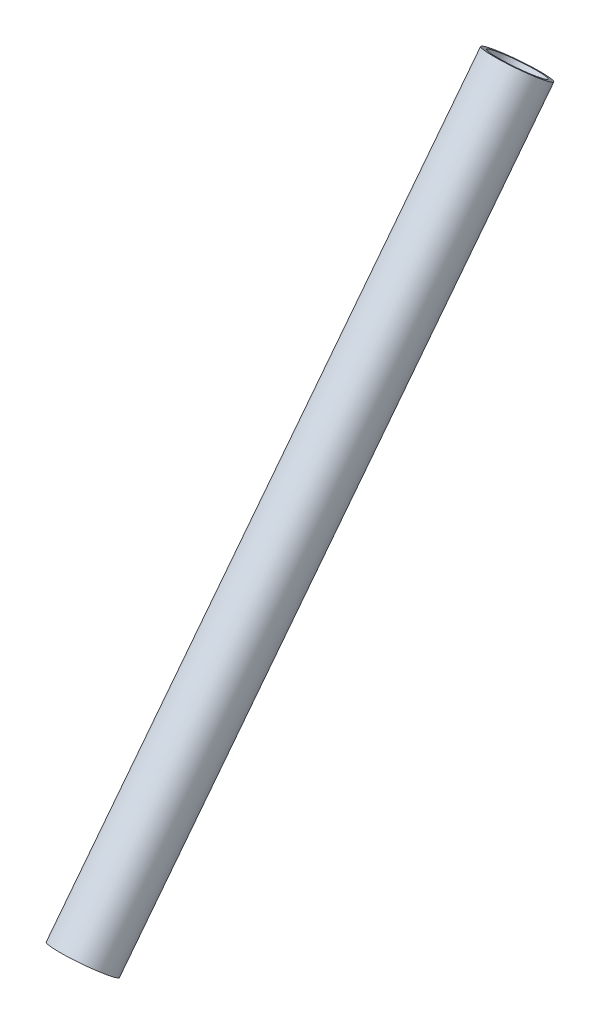
ISO-10303-21;
HEADER;
FILE_DESCRIPTION(('STEP AP214'),'2;1');
FILE_NAME('part.step','',(''),(''),'','','');
FILE_SCHEMA(('AUTOMOTIVE_DESIGN { 1 0 10303 214 1 1 1 1 }'));
ENDSEC;
DATA;
#1=APPLICATION_CONTEXT('core data for automotive mechanical design processes');
#2=APPLICATION_PROTOCOL_DEFINITION('international standard','automotive_design',2000,#1);
#3=PRODUCT_CONTEXT('',#1,'mechanical');
#4=PRODUCT('Part','Part','',(#3));
#5=PRODUCT_RELATED_PRODUCT_CATEGORY('part','',(#4));
#6=PRODUCT_DEFINITION_FORMATION('','',#4);
#7=PRODUCT_DEFINITION_CONTEXT('part definition',#1,'design');
#8=PRODUCT_DEFINITION('design','',#6,#7);
#9=PRODUCT_DEFINITION_SHAPE('','',#8);
#10=(LENGTH_UNIT() NAMED_UNIT(*) SI_UNIT(.MILLI.,.METRE.));
#11=(NAMED_UNIT(*) PLANE_ANGLE_UNIT() SI_UNIT($,.RADIAN.));
#12=(NAMED_UNIT(*) SI_UNIT($,.STERADIAN.) SOLID_ANGLE_UNIT());
#13=UNCERTAINTY_MEASURE_WITH_UNIT(LENGTH_MEASURE(1.E-05),#10,'distance_accuracy_value','');
#14=(GEOMETRIC_REPRESENTATION_CONTEXT(3) GLOBAL_UNCERTAINTY_ASSIGNED_CONTEXT((#13)) GLOBAL_UNIT_ASSIGNED_CONTEXT((#10,
#11,#12)) REPRESENTATION_CONTEXT('',''));
#15=CARTESIAN_POINT('',(0.,0.,0.));
#16=DIRECTION('',(0.,0.,1.));
#17=DIRECTION('',(1.,0.,0.));
#18=AXIS2_PLACEMENT_3D('',#15,#16,#17);
#19=CARTESIAN_POINT('',(709.53,493.285000014861,61.4018662620985));
#20=DIRECTION('',(0.,-0.789325842362673,0.613974522743784));
#21=DIRECTION('',(0.,-0.613974522743784,-0.789325842362673));
#22=AXIS2_PLACEMENT_3D('',#19,#20,#21);
#23=PLANE('',#22);
#24=CARTESIAN_POINT('',(709.53,493.285000014861,61.4018662620985));
#25=DIRECTION('',(0.,-0.789325842362673,0.613974522743784));
#26=DIRECTION('',(0.,-0.613974522743784,-0.789325842362673));
#27=AXIS2_PLACEMENT_3D('',#24,#25,#26);
#28=CIRCLE('',#27,5.34999999999997);
#29=CARTESIAN_POINT('',(709.53,490.000236318182,57.1789730054583));
#30=VERTEX_POINT('',#29);
#31=EDGE_CURVE('E59',#30,#30,#28,.T.);
#32=ORIENTED_EDGE('',*,*,#31,.T.);
#33=EDGE_LOOP('',(#32));
#34=FACE_BOUND('',#33,.T.);
#35=CARTESIAN_POINT('',(709.53,493.285000014861,61.4018662620985));
#36=DIRECTION('',(0.,-0.789325842362673,0.613974522743784));
#37=DIRECTION('',(0.,-0.613974522743784,-0.789325842362673));
#38=AXIS2_PLACEMENT_3D('',#35,#36,#37);
#39=CIRCLE('',#38,6.34999999999997);
#40=CARTESIAN_POINT('',(709.53,489.386261795438,56.3896471630956));
#41=VERTEX_POINT('',#40);
#42=EDGE_CURVE('E51',#41,#41,#39,.T.);
#43=ORIENTED_EDGE('',*,*,#42,.F.);
#44=EDGE_LOOP('',(#43));
#45=FACE_BOUND('',#44,.T.);
#46=ADVANCED_FACE('F45',(#34,#45),#23,.F.);
#47=CARTESIAN_POINT('',(709.53,370.154999985139,157.178133737902));
#48=DIRECTION('',(0.,-0.789325842362673,0.613974522743784));
#49=DIRECTION('',(0.,-0.613974522743784,-0.789325842362673));
#50=AXIS2_PLACEMENT_3D('',#47,#48,#49);
#51=PLANE('',#50);
#52=CARTESIAN_POINT('',(709.53,370.154999985139,157.178133737902));
#53=DIRECTION('',(0.,-0.789325842362673,0.613974522743784));
#54=DIRECTION('',(0.,-0.613974522743784,-0.789325842362673));
#55=AXIS2_PLACEMENT_3D('',#52,#53,#54);
#56=CIRCLE('',#55,5.34999999999997);
#57=CARTESIAN_POINT('',(709.53,366.87023628846,152.955240481261));
#58=VERTEX_POINT('',#57);
#59=EDGE_CURVE('E55',#58,#58,#56,.T.);
#60=ORIENTED_EDGE('',*,*,#59,.F.);
#61=EDGE_LOOP('',(#60));
#62=FACE_BOUND('',#61,.T.);
#63=CARTESIAN_POINT('',(709.53,370.154999985139,157.178133737902));
#64=DIRECTION('',(0.,-0.789325842362673,0.613974522743784));
#65=DIRECTION('',(0.,-0.613974522743784,-0.789325842362673));
#66=AXIS2_PLACEMENT_3D('',#63,#64,#65);
#67=CIRCLE('',#66,6.34999999999997);
#68=CARTESIAN_POINT('',(709.53,366.256261765716,152.165914638899));
#69=VERTEX_POINT('',#68);
#70=EDGE_CURVE('E11',#69,#69,#67,.T.);
#71=ORIENTED_EDGE('',*,*,#70,.T.);
#72=EDGE_LOOP('',(#71));
#73=FACE_BOUND('',#72,.T.);
#74=ADVANCED_FACE('F75',(#62,#73),#51,.T.);
#75=CARTESIAN_POINT('',(709.53,493.285000014861,61.4018662620985));
#76=DIRECTION('',(0.,-0.789325842362672,0.613974522743785));
#77=DIRECTION('',(0.,-0.613974522743785,-0.789325842362672));
#78=AXIS2_PLACEMENT_3D('',#75,#76,#77);
#79=CYLINDRICAL_SURFACE('',#78,6.34999999999997);
#80=ORIENTED_EDGE('',*,*,#70,.F.);
#81=EDGE_LOOP('',(#80));
#82=FACE_BOUND('',#81,.T.);
#83=ORIENTED_EDGE('',*,*,#42,.T.);
#84=EDGE_LOOP('',(#83));
#85=FACE_BOUND('',#84,.T.);
#86=ADVANCED_FACE('F69',(#82,#85),#79,.T.);
#87=CARTESIAN_POINT('',(709.53,493.285000014861,61.4018662620985));
#88=DIRECTION('',(0.,-0.789325842362672,0.613974522743785));
#89=DIRECTION('',(0.,-0.613974522743785,-0.789325842362672));
#90=AXIS2_PLACEMENT_3D('',#87,#88,#89);
#91=CYLINDRICAL_SURFACE('',#90,5.34999999999997);
#92=ORIENTED_EDGE('',*,*,#59,.T.);
#93=EDGE_LOOP('',(#92));
#94=FACE_BOUND('',#93,.T.);
#95=ORIENTED_EDGE('',*,*,#31,.F.);
#96=EDGE_LOOP('',(#95));
#97=FACE_BOUND('',#96,.T.);
#98=ADVANCED_FACE('F67',(#94,#97),#91,.F.);
#99=CLOSED_SHELL('',(#46,#74,#86,#98));
#100=MANIFOLD_SOLID_BREP('B2',#99);
#101=ADVANCED_BREP_SHAPE_REPRESENTATION('',(#18,#100),#14);
#102=SHAPE_DEFINITION_REPRESENTATION(#9,#101);
ENDSEC;
END-ISO-10303-21;
